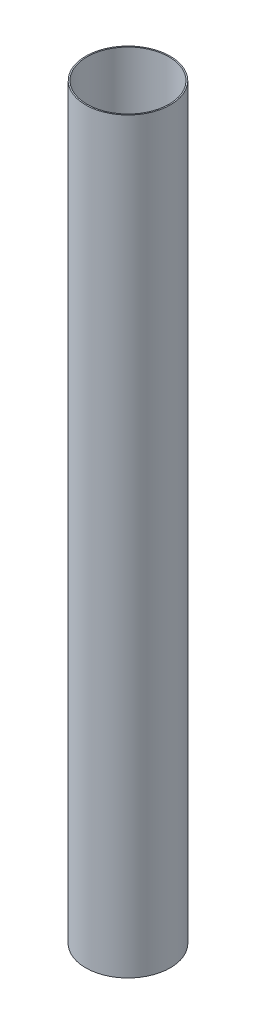
ISO-10303-21;
HEADER;
FILE_DESCRIPTION(('STEP AP214'),'2;1');
FILE_NAME('part.step','',(''),(''),'','','');
FILE_SCHEMA(('AUTOMOTIVE_DESIGN { 1 0 10303 214 1 1 1 1 }'));
ENDSEC;
DATA;
#1=APPLICATION_CONTEXT('core data for automotive mechanical design processes');
#2=APPLICATION_PROTOCOL_DEFINITION('international standard','automotive_design',2000,#1);
#3=PRODUCT_CONTEXT('',#1,'mechanical');
#4=PRODUCT('Part','Part','',(#3));
#5=PRODUCT_RELATED_PRODUCT_CATEGORY('part','',(#4));
#6=PRODUCT_DEFINITION_FORMATION('','',#4);
#7=PRODUCT_DEFINITION_CONTEXT('part definition',#1,'design');
#8=PRODUCT_DEFINITION('design','',#6,#7);
#9=PRODUCT_DEFINITION_SHAPE('','',#8);
#10=(LENGTH_UNIT() NAMED_UNIT(*) SI_UNIT(.MILLI.,.METRE.));
#11=(NAMED_UNIT(*) PLANE_ANGLE_UNIT() SI_UNIT($,.RADIAN.));
#12=(NAMED_UNIT(*) SI_UNIT($,.STERADIAN.) SOLID_ANGLE_UNIT());
#13=UNCERTAINTY_MEASURE_WITH_UNIT(LENGTH_MEASURE(1.E-05),#10,'distance_accuracy_value','');
#14=(GEOMETRIC_REPRESENTATION_CONTEXT(3) GLOBAL_UNCERTAINTY_ASSIGNED_CONTEXT((#13)) GLOBAL_UNIT_ASSIGNED_CONTEXT((#10,
#11,#12)) REPRESENTATION_CONTEXT('',''));
#15=CARTESIAN_POINT('',(0.,0.,0.));
#16=DIRECTION('',(0.,0.,1.));
#17=DIRECTION('',(1.,0.,0.));
#18=AXIS2_PLACEMENT_3D('',#15,#16,#17);
#19=CARTESIAN_POINT('',(0.,577.85,0.));
#20=DIRECTION('',(0.,1.,0.));
#21=DIRECTION('',(0.,0.,1.));
#22=AXIS2_PLACEMENT_3D('',#19,#20,#21);
#23=PLANE('',#22);
#24=CARTESIAN_POINT('',(0.,577.85,0.));
#25=DIRECTION('',(0.,1.,0.));
#26=DIRECTION('',(0.,0.,1.));
#27=AXIS2_PLACEMENT_3D('',#24,#25,#26);
#28=CIRCLE('',#27,65.405);
#29=CARTESIAN_POINT('',(0.,577.85,65.405));
#30=VERTEX_POINT('',#29);
#31=EDGE_CURVE('E10',#30,#30,#28,.T.);
#32=ORIENTED_EDGE('',*,*,#31,.T.);
#33=EDGE_LOOP('',(#32));
#34=FACE_BOUND('',#33,.T.);
#35=CARTESIAN_POINT('',(0.,577.85,0.));
#36=DIRECTION('',(0.,1.,0.));
#37=DIRECTION('',(0.,0.,1.));
#38=AXIS2_PLACEMENT_3D('',#35,#36,#37);
#39=CIRCLE('',#38,63.5);
#40=CARTESIAN_POINT('',(0.,577.85,63.5));
#41=VERTEX_POINT('',#40);
#42=EDGE_CURVE('E54',#41,#41,#39,.T.);
#43=ORIENTED_EDGE('',*,*,#42,.F.);
#44=EDGE_LOOP('',(#43));
#45=FACE_BOUND('',#44,.T.);
#46=ADVANCED_FACE('F41',(#34,#45),#23,.T.);
#47=CARTESIAN_POINT('',(0.,-577.85,0.));
#48=DIRECTION('',(0.,1.,0.));
#49=DIRECTION('',(0.,0.,1.));
#50=AXIS2_PLACEMENT_3D('',#47,#48,#49);
#51=PLANE('',#50);
#52=CARTESIAN_POINT('',(0.,-577.85,0.));
#53=DIRECTION('',(0.,1.,0.));
#54=DIRECTION('',(0.,0.,1.));
#55=AXIS2_PLACEMENT_3D('',#52,#53,#54);
#56=CIRCLE('',#55,65.405);
#57=CARTESIAN_POINT('',(0.,-577.85,65.405));
#58=VERTEX_POINT('',#57);
#59=EDGE_CURVE('E45',#58,#58,#56,.T.);
#60=ORIENTED_EDGE('',*,*,#59,.F.);
#61=EDGE_LOOP('',(#60));
#62=FACE_BOUND('',#61,.T.);
#63=CARTESIAN_POINT('',(0.,-577.85,0.));
#64=DIRECTION('',(0.,1.,0.));
#65=DIRECTION('',(0.,0.,1.));
#66=AXIS2_PLACEMENT_3D('',#63,#64,#65);
#67=CIRCLE('',#66,63.5);
#68=CARTESIAN_POINT('',(0.,-577.85,63.5));
#69=VERTEX_POINT('',#68);
#70=EDGE_CURVE('E56',#69,#69,#67,.T.);
#71=ORIENTED_EDGE('',*,*,#70,.T.);
#72=EDGE_LOOP('',(#71));
#73=FACE_BOUND('',#72,.T.);
#74=ADVANCED_FACE('F68',(#62,#73),#51,.F.);
#75=CARTESIAN_POINT('',(0.,577.85,0.));
#76=DIRECTION('',(0.,-1.,0.));
#77=DIRECTION('',(0.,0.,-1.));
#78=AXIS2_PLACEMENT_3D('',#75,#76,#77);
#79=CYLINDRICAL_SURFACE('',#78,65.405);
#80=ORIENTED_EDGE('',*,*,#31,.F.);
#81=EDGE_LOOP('',(#80));
#82=FACE_BOUND('',#81,.T.);
#83=ORIENTED_EDGE('',*,*,#59,.T.);
#84=EDGE_LOOP('',(#83));
#85=FACE_BOUND('',#84,.T.);
#86=ADVANCED_FACE('F43',(#82,#85),#79,.T.);
#87=CARTESIAN_POINT('',(0.,577.85,0.));
#88=DIRECTION('',(0.,-1.,0.));
#89=DIRECTION('',(0.,0.,-1.));
#90=AXIS2_PLACEMENT_3D('',#87,#88,#89);
#91=CYLINDRICAL_SURFACE('',#90,63.5);
#92=ORIENTED_EDGE('',*,*,#42,.T.);
#93=EDGE_LOOP('',(#92));
#94=FACE_BOUND('',#93,.T.);
#95=ORIENTED_EDGE('',*,*,#70,.F.);
#96=EDGE_LOOP('',(#95));
#97=FACE_BOUND('',#96,.T.);
#98=ADVANCED_FACE('F64',(#94,#97),#91,.F.);
#99=CLOSED_SHELL('',(#46,#74,#86,#98));
#100=MANIFOLD_SOLID_BREP('B2',#99);
#101=ADVANCED_BREP_SHAPE_REPRESENTATION('',(#18,#100),#14);
#102=SHAPE_DEFINITION_REPRESENTATION(#9,#101);
ENDSEC;
END-ISO-10303-21;
